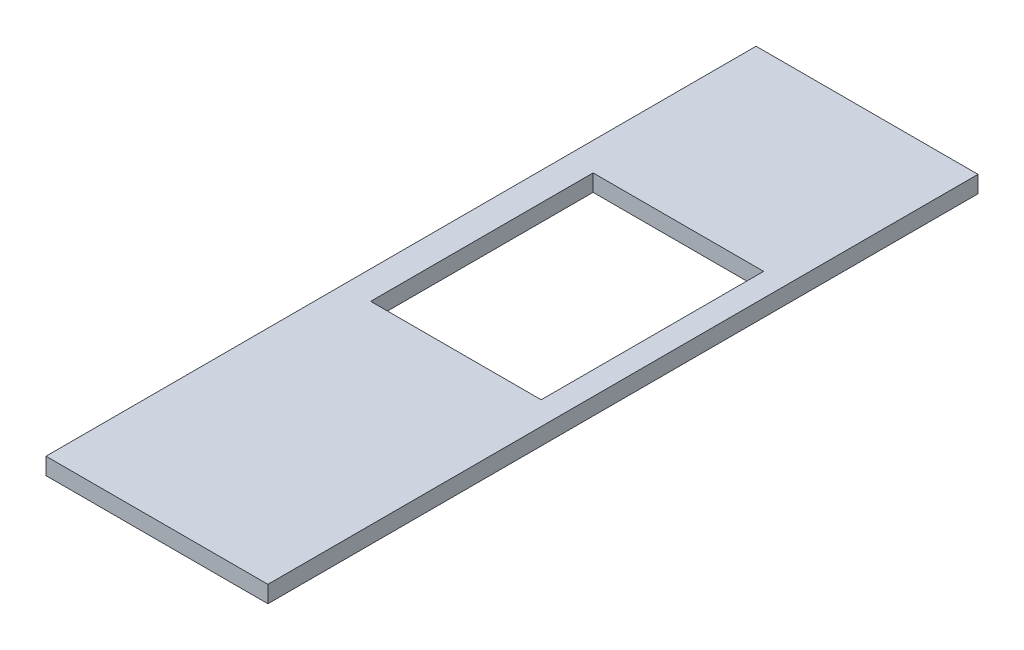
ISO-10303-21;
HEADER;
FILE_DESCRIPTION(('STEP AP214'),'2;1');
FILE_NAME('part.step','',(''),(''),'','','');
FILE_SCHEMA(('AUTOMOTIVE_DESIGN { 1 0 10303 214 1 1 1 1 }'));
ENDSEC;
DATA;
#1=APPLICATION_CONTEXT('core data for automotive mechanical design processes');
#2=APPLICATION_PROTOCOL_DEFINITION('international standard','automotive_design',2000,#1);
#3=PRODUCT_CONTEXT('',#1,'mechanical');
#4=PRODUCT('Part','Part','',(#3));
#5=PRODUCT_RELATED_PRODUCT_CATEGORY('part','',(#4));
#6=PRODUCT_DEFINITION_FORMATION('','',#4);
#7=PRODUCT_DEFINITION_CONTEXT('part definition',#1,'design');
#8=PRODUCT_DEFINITION('design','',#6,#7);
#9=PRODUCT_DEFINITION_SHAPE('','',#8);
#10=(LENGTH_UNIT() NAMED_UNIT(*) SI_UNIT(.MILLI.,.METRE.));
#11=(NAMED_UNIT(*) PLANE_ANGLE_UNIT() SI_UNIT($,.RADIAN.));
#12=(NAMED_UNIT(*) SI_UNIT($,.STERADIAN.) SOLID_ANGLE_UNIT());
#13=UNCERTAINTY_MEASURE_WITH_UNIT(LENGTH_MEASURE(1.E-05),#10,'distance_accuracy_value','');
#14=(GEOMETRIC_REPRESENTATION_CONTEXT(3) GLOBAL_UNCERTAINTY_ASSIGNED_CONTEXT((#13)) GLOBAL_UNIT_ASSIGNED_CONTEXT((#10,
#11,#12)) REPRESENTATION_CONTEXT('',''));
#15=CARTESIAN_POINT('',(0.,0.,0.));
#16=DIRECTION('',(0.,0.,1.));
#17=DIRECTION('',(1.,0.,0.));
#18=AXIS2_PLACEMENT_3D('',#15,#16,#17);
#19=CARTESIAN_POINT('',(500.,38.,0.));
#20=DIRECTION('',(0.,0.,-1.));
#21=DIRECTION('',(-1.,0.,0.));
#22=AXIS2_PLACEMENT_3D('',#19,#20,#21);
#23=PLANE('',#22);
#24=DIRECTION('',(1.,0.,0.));
#25=VECTOR('',#24,1.);
#26=CARTESIAN_POINT('',(500.,0.,0.));
#27=LINE('',#26,#25);
#28=CARTESIAN_POINT('',(0.,0.,0.));
#29=VERTEX_POINT('',#28);
#30=CARTESIAN_POINT('',(500.,0.,0.));
#31=VERTEX_POINT('',#30);
#32=EDGE_CURVE('E136',#29,#31,#27,.T.);
#33=ORIENTED_EDGE('',*,*,#32,.T.);
#34=DIRECTION('',(0.,-1.,0.));
#35=VECTOR('',#34,1.);
#36=CARTESIAN_POINT('',(500.,38.,0.));
#37=LINE('',#36,#35);
#38=CARTESIAN_POINT('',(500.,38.,0.));
#39=VERTEX_POINT('',#38);
#40=EDGE_CURVE('E11',#39,#31,#37,.T.);
#41=ORIENTED_EDGE('',*,*,#40,.F.);
#42=DIRECTION('',(1.,0.,0.));
#43=VECTOR('',#42,1.);
#44=CARTESIAN_POINT('',(500.,38.,0.));
#45=LINE('',#44,#43);
#46=CARTESIAN_POINT('',(0.,38.,0.));
#47=VERTEX_POINT('',#46);
#48=EDGE_CURVE('E140',#47,#39,#45,.T.);
#49=ORIENTED_EDGE('',*,*,#48,.F.);
#50=DIRECTION('',(0.,-1.,0.));
#51=VECTOR('',#50,1.);
#52=CARTESIAN_POINT('',(0.,38.,0.));
#53=LINE('',#52,#51);
#54=EDGE_CURVE('E150',#47,#29,#53,.T.);
#55=ORIENTED_EDGE('',*,*,#54,.T.);
#56=EDGE_LOOP('',(#33,#41,#49,#55));
#57=FACE_BOUND('',#56,.T.);
#58=ADVANCED_FACE('F39',(#57),#23,.F.);
#59=CARTESIAN_POINT('',(500.,38.,-1600.));
#60=DIRECTION('',(-1.,0.,0.));
#61=DIRECTION('',(0.,0.,1.));
#62=AXIS2_PLACEMENT_3D('',#59,#60,#61);
#63=PLANE('',#62);
#64=DIRECTION('',(0.,0.,-1.));
#65=VECTOR('',#64,1.);
#66=CARTESIAN_POINT('',(500.,0.,-1600.));
#67=LINE('',#66,#65);
#68=CARTESIAN_POINT('',(500.,0.,-1600.));
#69=VERTEX_POINT('',#68);
#70=EDGE_CURVE('E153',#31,#69,#67,.T.);
#71=ORIENTED_EDGE('',*,*,#70,.T.);
#72=DIRECTION('',(0.,-1.,0.));
#73=VECTOR('',#72,1.);
#74=CARTESIAN_POINT('',(500.,38.,-1600.));
#75=LINE('',#74,#73);
#76=CARTESIAN_POINT('',(500.,38.,-1600.));
#77=VERTEX_POINT('',#76);
#78=EDGE_CURVE('E46',#77,#69,#75,.T.);
#79=ORIENTED_EDGE('',*,*,#78,.F.);
#80=DIRECTION('',(0.,0.,-1.));
#81=VECTOR('',#80,1.);
#82=CARTESIAN_POINT('',(500.,38.,-1600.));
#83=LINE('',#82,#81);
#84=EDGE_CURVE('E143',#39,#77,#83,.T.);
#85=ORIENTED_EDGE('',*,*,#84,.F.);
#86=ORIENTED_EDGE('',*,*,#40,.T.);
#87=EDGE_LOOP('',(#71,#79,#85,#86));
#88=FACE_BOUND('',#87,.T.);
#89=ADVANCED_FACE('F181',(#88),#63,.F.);
#90=CARTESIAN_POINT('',(0.,38.,-1600.));
#91=DIRECTION('',(0.,0.,1.));
#92=DIRECTION('',(1.,0.,0.));
#93=AXIS2_PLACEMENT_3D('',#90,#91,#92);
#94=PLANE('',#93);
#95=DIRECTION('',(-1.,0.,0.));
#96=VECTOR('',#95,1.);
#97=CARTESIAN_POINT('',(0.,0.,-1600.));
#98=LINE('',#97,#96);
#99=CARTESIAN_POINT('',(0.,0.,-1600.));
#100=VERTEX_POINT('',#99);
#101=EDGE_CURVE('E155',#69,#100,#98,.T.);
#102=ORIENTED_EDGE('',*,*,#101,.T.);
#103=DIRECTION('',(0.,-1.,0.));
#104=VECTOR('',#103,1.);
#105=CARTESIAN_POINT('',(0.,38.,-1600.));
#106=LINE('',#105,#104);
#107=CARTESIAN_POINT('',(0.,38.,-1600.));
#108=VERTEX_POINT('',#107);
#109=EDGE_CURVE('E160',#108,#100,#106,.T.);
#110=ORIENTED_EDGE('',*,*,#109,.F.);
#111=DIRECTION('',(-1.,0.,0.));
#112=VECTOR('',#111,1.);
#113=CARTESIAN_POINT('',(0.,38.,-1600.));
#114=LINE('',#113,#112);
#115=EDGE_CURVE('E146',#77,#108,#114,.T.);
#116=ORIENTED_EDGE('',*,*,#115,.F.);
#117=ORIENTED_EDGE('',*,*,#78,.T.);
#118=EDGE_LOOP('',(#102,#110,#116,#117));
#119=FACE_BOUND('',#118,.T.);
#120=ADVANCED_FACE('F167',(#119),#94,.F.);
#121=CARTESIAN_POINT('',(0.,38.,0.));
#122=DIRECTION('',(1.,0.,0.));
#123=DIRECTION('',(0.,0.,-1.));
#124=AXIS2_PLACEMENT_3D('',#121,#122,#123);
#125=PLANE('',#124);
#126=DIRECTION('',(0.,0.,1.));
#127=VECTOR('',#126,1.);
#128=CARTESIAN_POINT('',(0.,0.,0.));
#129=LINE('',#128,#127);
#130=EDGE_CURVE('E144',#100,#29,#129,.T.);
#131=ORIENTED_EDGE('',*,*,#130,.T.);
#132=ORIENTED_EDGE('',*,*,#54,.F.);
#133=DIRECTION('',(0.,0.,1.));
#134=VECTOR('',#133,1.);
#135=CARTESIAN_POINT('',(0.,38.,0.));
#136=LINE('',#135,#134);
#137=EDGE_CURVE('E148',#108,#47,#136,.T.);
#138=ORIENTED_EDGE('',*,*,#137,.F.);
#139=ORIENTED_EDGE('',*,*,#109,.T.);
#140=EDGE_LOOP('',(#131,#132,#138,#139));
#141=FACE_BOUND('',#140,.T.);
#142=ADVANCED_FACE('F174',(#141),#125,.F.);
#143=CARTESIAN_POINT('',(0.,38.,0.));
#144=DIRECTION('',(0.,-1.,0.));
#145=DIRECTION('',(0.,0.,-1.));
#146=AXIS2_PLACEMENT_3D('',#143,#144,#145);
#147=PLANE('',#146);
#148=DIRECTION('',(1.,0.,0.));
#149=VECTOR('',#148,1.);
#150=CARTESIAN_POINT('',(63.5682660139294,38.,-667.947839199008));
#151=LINE('',#150,#149);
#152=CARTESIAN_POINT('',(63.5682660139294,38.,-667.947839199008));
#153=VERTEX_POINT('',#152);
#154=CARTESIAN_POINT('',(447.784054615876,38.,-667.947839199008));
#155=VERTEX_POINT('',#154);
#156=EDGE_CURVE('E130',#153,#155,#151,.T.);
#157=ORIENTED_EDGE('',*,*,#156,.F.);
#158=DIRECTION('',(0.,0.,1.));
#159=VECTOR('',#158,1.);
#160=CARTESIAN_POINT('',(63.5682660139294,38.,-1169.17730788681));
#161=LINE('',#160,#159);
#162=CARTESIAN_POINT('',(63.5682660139294,38.,-1169.17730788681));
#163=VERTEX_POINT('',#162);
#164=EDGE_CURVE('E53',#163,#153,#161,.T.);
#165=ORIENTED_EDGE('',*,*,#164,.F.);
#166=DIRECTION('',(-1.,0.,0.));
#167=VECTOR('',#166,1.);
#168=CARTESIAN_POINT('',(63.5682660139294,38.,-1169.17730788681));
#169=LINE('',#168,#167);
#170=CARTESIAN_POINT('',(447.784054615876,38.,-1169.17730788681));
#171=VERTEX_POINT('',#170);
#172=EDGE_CURVE('E121',#171,#163,#169,.T.);
#173=ORIENTED_EDGE('',*,*,#172,.F.);
#174=DIRECTION('',(0.,0.,-1.));
#175=VECTOR('',#174,1.);
#176=CARTESIAN_POINT('',(447.784054615876,38.,-1169.17730788681));
#177=LINE('',#176,#175);
#178=EDGE_CURVE('E124',#155,#171,#177,.T.);
#179=ORIENTED_EDGE('',*,*,#178,.F.);
#180=EDGE_LOOP('',(#157,#165,#173,#179));
#181=FACE_BOUND('',#180,.T.);
#182=ORIENTED_EDGE('',*,*,#48,.T.);
#183=ORIENTED_EDGE('',*,*,#84,.T.);
#184=ORIENTED_EDGE('',*,*,#115,.T.);
#185=ORIENTED_EDGE('',*,*,#137,.T.);
#186=EDGE_LOOP('',(#182,#183,#184,#185));
#187=FACE_BOUND('',#186,.T.);
#188=ADVANCED_FACE('F180',(#181,#187),#147,.F.);
#189=CARTESIAN_POINT('',(0.,0.,0.));
#190=DIRECTION('',(0.,-1.,0.));
#191=DIRECTION('',(0.,0.,-1.));
#192=AXIS2_PLACEMENT_3D('',#189,#190,#191);
#193=PLANE('',#192);
#194=DIRECTION('',(0.,0.,1.));
#195=VECTOR('',#194,1.);
#196=CARTESIAN_POINT('',(63.5682660139294,0.,-1169.17730788681));
#197=LINE('',#196,#195);
#198=CARTESIAN_POINT('',(63.5682660139294,0.,-1169.17730788681));
#199=VERTEX_POINT('',#198);
#200=CARTESIAN_POINT('',(63.5682660139294,0.,-667.947839199008));
#201=VERTEX_POINT('',#200);
#202=EDGE_CURVE('E105',#199,#201,#197,.T.);
#203=ORIENTED_EDGE('',*,*,#202,.T.);
#204=DIRECTION('',(1.,0.,0.));
#205=VECTOR('',#204,1.);
#206=CARTESIAN_POINT('',(63.5682660139294,0.,-667.947839199008));
#207=LINE('',#206,#205);
#208=CARTESIAN_POINT('',(447.784054615876,0.,-667.947839199008));
#209=VERTEX_POINT('',#208);
#210=EDGE_CURVE('E114',#201,#209,#207,.T.);
#211=ORIENTED_EDGE('',*,*,#210,.T.);
#212=DIRECTION('',(0.,0.,-1.));
#213=VECTOR('',#212,1.);
#214=CARTESIAN_POINT('',(447.784054615876,0.,-1169.17730788681));
#215=LINE('',#214,#213);
#216=CARTESIAN_POINT('',(447.784054615876,0.,-1169.17730788681));
#217=VERTEX_POINT('',#216);
#218=EDGE_CURVE('E61',#209,#217,#215,.T.);
#219=ORIENTED_EDGE('',*,*,#218,.T.);
#220=DIRECTION('',(-1.,0.,0.));
#221=VECTOR('',#220,1.);
#222=CARTESIAN_POINT('',(63.5682660139294,0.,-1169.17730788681));
#223=LINE('',#222,#221);
#224=EDGE_CURVE('E111',#217,#199,#223,.T.);
#225=ORIENTED_EDGE('',*,*,#224,.T.);
#226=EDGE_LOOP('',(#203,#211,#219,#225));
#227=FACE_BOUND('',#226,.T.);
#228=ORIENTED_EDGE('',*,*,#32,.F.);
#229=ORIENTED_EDGE('',*,*,#130,.F.);
#230=ORIENTED_EDGE('',*,*,#101,.F.);
#231=ORIENTED_EDGE('',*,*,#70,.F.);
#232=EDGE_LOOP('',(#228,#229,#230,#231));
#233=FACE_BOUND('',#232,.T.);
#234=ADVANCED_FACE('F118',(#227,#233),#193,.T.);
#235=CARTESIAN_POINT('',(63.5682660139294,0.,-1169.17730788681));
#236=DIRECTION('',(-1.,0.,0.));
#237=DIRECTION('',(0.,0.,1.));
#238=AXIS2_PLACEMENT_3D('',#235,#236,#237);
#239=PLANE('',#238);
#240=ORIENTED_EDGE('',*,*,#164,.T.);
#241=DIRECTION('',(0.,1.,0.));
#242=VECTOR('',#241,1.);
#243=CARTESIAN_POINT('',(63.5682660139294,0.,-667.947839199008));
#244=LINE('',#243,#242);
#245=EDGE_CURVE('E101',#201,#153,#244,.T.);
#246=ORIENTED_EDGE('',*,*,#245,.F.);
#247=ORIENTED_EDGE('',*,*,#202,.F.);
#248=DIRECTION('',(0.,1.,0.));
#249=VECTOR('',#248,1.);
#250=CARTESIAN_POINT('',(63.5682660139294,0.,-1169.17730788681));
#251=LINE('',#250,#249);
#252=EDGE_CURVE('E134',#199,#163,#251,.T.);
#253=ORIENTED_EDGE('',*,*,#252,.T.);
#254=EDGE_LOOP('',(#240,#246,#247,#253));
#255=FACE_BOUND('',#254,.T.);
#256=ADVANCED_FACE('F103',(#255),#239,.F.);
#257=CARTESIAN_POINT('',(63.5682660139294,0.,-1169.17730788681));
#258=DIRECTION('',(0.,0.,-1.));
#259=DIRECTION('',(-1.,0.,0.));
#260=AXIS2_PLACEMENT_3D('',#257,#258,#259);
#261=PLANE('',#260);
#262=ORIENTED_EDGE('',*,*,#172,.T.);
#263=ORIENTED_EDGE('',*,*,#252,.F.);
#264=ORIENTED_EDGE('',*,*,#224,.F.);
#265=DIRECTION('',(0.,1.,0.));
#266=VECTOR('',#265,1.);
#267=CARTESIAN_POINT('',(447.784054615876,0.,-1169.17730788681));
#268=LINE('',#267,#266);
#269=EDGE_CURVE('E137',#217,#171,#268,.T.);
#270=ORIENTED_EDGE('',*,*,#269,.T.);
#271=EDGE_LOOP('',(#262,#263,#264,#270));
#272=FACE_BOUND('',#271,.T.);
#273=ADVANCED_FACE('F198',(#272),#261,.F.);
#274=CARTESIAN_POINT('',(447.784054615876,0.,-1169.17730788681));
#275=DIRECTION('',(1.,0.,0.));
#276=DIRECTION('',(0.,0.,-1.));
#277=AXIS2_PLACEMENT_3D('',#274,#275,#276);
#278=PLANE('',#277);
#279=ORIENTED_EDGE('',*,*,#178,.T.);
#280=ORIENTED_EDGE('',*,*,#269,.F.);
#281=ORIENTED_EDGE('',*,*,#218,.F.);
#282=DIRECTION('',(0.,1.,0.));
#283=VECTOR('',#282,1.);
#284=CARTESIAN_POINT('',(447.784054615876,0.,-667.947839199008));
#285=LINE('',#284,#283);
#286=EDGE_CURVE('E110',#209,#155,#285,.T.);
#287=ORIENTED_EDGE('',*,*,#286,.T.);
#288=EDGE_LOOP('',(#279,#280,#281,#287));
#289=FACE_BOUND('',#288,.T.);
#290=ADVANCED_FACE('F201',(#289),#278,.F.);
#291=CARTESIAN_POINT('',(63.5682660139294,0.,-667.947839199008));
#292=DIRECTION('',(0.,0.,1.));
#293=DIRECTION('',(1.,0.,0.));
#294=AXIS2_PLACEMENT_3D('',#291,#292,#293);
#295=PLANE('',#294);
#296=ORIENTED_EDGE('',*,*,#156,.T.);
#297=ORIENTED_EDGE('',*,*,#286,.F.);
#298=ORIENTED_EDGE('',*,*,#210,.F.);
#299=ORIENTED_EDGE('',*,*,#245,.T.);
#300=EDGE_LOOP('',(#296,#297,#298,#299));
#301=FACE_BOUND('',#300,.T.);
#302=ADVANCED_FACE('F115',(#301),#295,.F.);
#303=CLOSED_SHELL('',(#58,#89,#120,#142,#188,#234,#256,#273,#290,#302));
#304=MANIFOLD_SOLID_BREP('B2',#303);
#305=ADVANCED_BREP_SHAPE_REPRESENTATION('',(#18,#304),#14);
#306=SHAPE_DEFINITION_REPRESENTATION(#9,#305);
ENDSEC;
END-ISO-10303-21;
